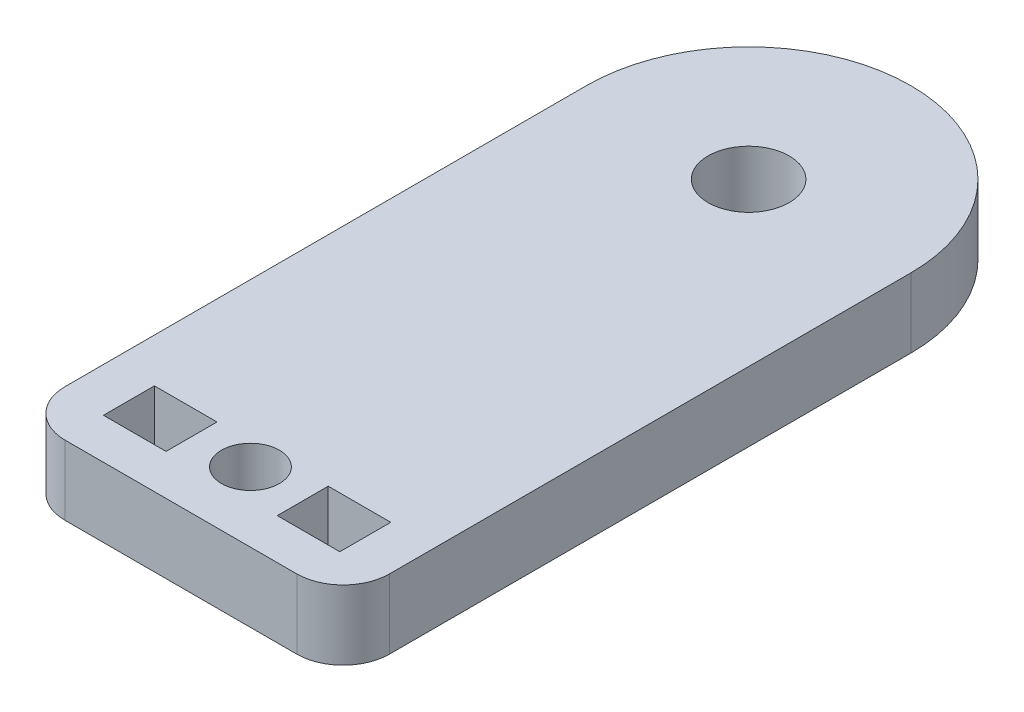
ISO-10303-21;
HEADER;
FILE_DESCRIPTION(('STEP AP214'),'2;1');
FILE_NAME('part.step','',(''),(''),'','','');
FILE_SCHEMA(('AUTOMOTIVE_DESIGN { 1 0 10303 214 1 1 1 1 }'));
ENDSEC;
DATA;
#1=APPLICATION_CONTEXT('core data for automotive mechanical design processes');
#2=APPLICATION_PROTOCOL_DEFINITION('international standard','automotive_design',2000,#1);
#3=PRODUCT_CONTEXT('',#1,'mechanical');
#4=PRODUCT('Part','Part','',(#3));
#5=PRODUCT_RELATED_PRODUCT_CATEGORY('part','',(#4));
#6=PRODUCT_DEFINITION_FORMATION('','',#4);
#7=PRODUCT_DEFINITION_CONTEXT('part definition',#1,'design');
#8=PRODUCT_DEFINITION('design','',#6,#7);
#9=PRODUCT_DEFINITION_SHAPE('','',#8);
#10=(LENGTH_UNIT() NAMED_UNIT(*) SI_UNIT(.MILLI.,.METRE.));
#11=(NAMED_UNIT(*) PLANE_ANGLE_UNIT() SI_UNIT($,.RADIAN.));
#12=(NAMED_UNIT(*) SI_UNIT($,.STERADIAN.) SOLID_ANGLE_UNIT());
#13=UNCERTAINTY_MEASURE_WITH_UNIT(LENGTH_MEASURE(1.E-05),#10,'distance_accuracy_value','');
#14=(GEOMETRIC_REPRESENTATION_CONTEXT(3) GLOBAL_UNCERTAINTY_ASSIGNED_CONTEXT((#13)) GLOBAL_UNIT_ASSIGNED_CONTEXT((#10,
#11,#12)) REPRESENTATION_CONTEXT('',''));
#15=CARTESIAN_POINT('',(0.,0.,0.));
#16=DIRECTION('',(0.,0.,1.));
#17=DIRECTION('',(1.,0.,0.));
#18=AXIS2_PLACEMENT_3D('',#15,#16,#17);
#19=CARTESIAN_POINT('',(0.,3.,10.4933909457973));
#20=DIRECTION('',(0.,0.,1.));
#21=DIRECTION('',(1.,0.,0.));
#22=AXIS2_PLACEMENT_3D('',#19,#20,#21);
#23=PLANE('',#22);
#24=DIRECTION('',(-1.,0.,0.));
#25=VECTOR('',#24,1.);
#26=CARTESIAN_POINT('',(0.,0.,10.4933909457973));
#27=LINE('',#26,#25);
#28=CARTESIAN_POINT('',(5.1,0.,10.4933909457973));
#29=VERTEX_POINT('',#28);
#30=CARTESIAN_POINT('',(2.40000000000001,0.,10.4933909457973));
#31=VERTEX_POINT('',#30);
#32=EDGE_CURVE('E205',#29,#31,#27,.T.);
#33=ORIENTED_EDGE('',*,*,#32,.T.);
#34=DIRECTION('',(0.,-1.,0.));
#35=VECTOR('',#34,1.);
#36=CARTESIAN_POINT('',(2.40000000000001,3.,10.4933909457973));
#37=LINE('',#36,#35);
#38=CARTESIAN_POINT('',(2.40000000000001,3.,10.4933909457973));
#39=VERTEX_POINT('',#38);
#40=EDGE_CURVE('E11',#39,#31,#37,.T.);
#41=ORIENTED_EDGE('',*,*,#40,.F.);
#42=DIRECTION('',(-1.,0.,0.));
#43=VECTOR('',#42,1.);
#44=CARTESIAN_POINT('',(0.,3.,10.4933909457973));
#45=LINE('',#44,#43);
#46=CARTESIAN_POINT('',(5.1,3.,10.4933909457973));
#47=VERTEX_POINT('',#46);
#48=EDGE_CURVE('E152',#47,#39,#45,.T.);
#49=ORIENTED_EDGE('',*,*,#48,.F.);
#50=DIRECTION('',(0.,-1.,0.));
#51=VECTOR('',#50,1.);
#52=CARTESIAN_POINT('',(5.1,3.,10.4933909457973));
#53=LINE('',#52,#51);
#54=EDGE_CURVE('E56',#47,#29,#53,.T.);
#55=ORIENTED_EDGE('',*,*,#54,.T.);
#56=EDGE_LOOP('',(#33,#41,#49,#55));
#57=FACE_BOUND('',#56,.T.);
#58=ADVANCED_FACE('F37',(#57),#23,.F.);
#59=CARTESIAN_POINT('',(2.4,3.,0.));
#60=DIRECTION('',(-1.,0.,0.));
#61=DIRECTION('',(0.,0.,1.));
#62=AXIS2_PLACEMENT_3D('',#59,#60,#61);
#63=PLANE('',#62);
#64=DIRECTION('',(0.,0.,-1.));
#65=VECTOR('',#64,1.);
#66=CARTESIAN_POINT('',(2.4,0.,0.));
#67=LINE('',#66,#65);
#68=CARTESIAN_POINT('',(2.4,0.,8.29339094579726));
#69=VERTEX_POINT('',#68);
#70=EDGE_CURVE('E158',#31,#69,#67,.T.);
#71=ORIENTED_EDGE('',*,*,#70,.T.);
#72=DIRECTION('',(0.,-1.,0.));
#73=VECTOR('',#72,1.);
#74=CARTESIAN_POINT('',(2.4,3.,8.29339094579726));
#75=LINE('',#74,#73);
#76=CARTESIAN_POINT('',(2.4,3.,8.29339094579726));
#77=VERTEX_POINT('',#76);
#78=EDGE_CURVE('E47',#77,#69,#75,.T.);
#79=ORIENTED_EDGE('',*,*,#78,.F.);
#80=DIRECTION('',(0.,0.,-1.));
#81=VECTOR('',#80,1.);
#82=CARTESIAN_POINT('',(2.4,3.,0.));
#83=LINE('',#82,#81);
#84=EDGE_CURVE('E146',#39,#77,#83,.T.);
#85=ORIENTED_EDGE('',*,*,#84,.F.);
#86=ORIENTED_EDGE('',*,*,#40,.T.);
#87=EDGE_LOOP('',(#71,#79,#85,#86));
#88=FACE_BOUND('',#87,.T.);
#89=ADVANCED_FACE('F157',(#88),#63,.F.);
#90=CARTESIAN_POINT('',(0.,3.,8.29339094579726));
#91=DIRECTION('',(0.,0.,1.));
#92=DIRECTION('',(1.,0.,0.));
#93=AXIS2_PLACEMENT_3D('',#90,#91,#92);
#94=PLANE('',#93);
#95=DIRECTION('',(-1.,0.,0.));
#96=VECTOR('',#95,1.);
#97=CARTESIAN_POINT('',(0.,0.,8.29339094579726));
#98=LINE('',#97,#96);
#99=CARTESIAN_POINT('',(5.1,0.,8.29339094579725));
#100=VERTEX_POINT('',#99);
#101=EDGE_CURVE('E208',#100,#69,#98,.T.);
#102=ORIENTED_EDGE('',*,*,#101,.F.);
#103=DIRECTION('',(0.,-1.,0.));
#104=VECTOR('',#103,1.);
#105=CARTESIAN_POINT('',(5.1,3.,8.29339094579725));
#106=LINE('',#105,#104);
#107=CARTESIAN_POINT('',(5.1,3.,8.29339094579725));
#108=VERTEX_POINT('',#107);
#109=EDGE_CURVE('E100',#108,#100,#106,.T.);
#110=ORIENTED_EDGE('',*,*,#109,.F.);
#111=DIRECTION('',(-1.,0.,0.));
#112=VECTOR('',#111,1.);
#113=CARTESIAN_POINT('',(0.,3.,8.29339094579726));
#114=LINE('',#113,#112);
#115=EDGE_CURVE('E151',#108,#77,#114,.T.);
#116=ORIENTED_EDGE('',*,*,#115,.T.);
#117=ORIENTED_EDGE('',*,*,#78,.T.);
#118=EDGE_LOOP('',(#102,#110,#116,#117));
#119=FACE_BOUND('',#118,.T.);
#120=ADVANCED_FACE('F162',(#119),#94,.T.);
#121=CARTESIAN_POINT('',(-2.4,3.,0.));
#122=DIRECTION('',(-1.,0.,0.));
#123=DIRECTION('',(0.,0.,1.));
#124=AXIS2_PLACEMENT_3D('',#121,#122,#123);
#125=PLANE('',#124);
#126=DIRECTION('',(0.,0.,-1.));
#127=VECTOR('',#126,1.);
#128=CARTESIAN_POINT('',(-2.4,0.,0.));
#129=LINE('',#128,#127);
#130=CARTESIAN_POINT('',(-2.4,0.,10.4933909457973));
#131=VERTEX_POINT('',#130);
#132=CARTESIAN_POINT('',(-2.4,0.,8.29339094579726));
#133=VERTEX_POINT('',#132);
#134=EDGE_CURVE('E193',#131,#133,#129,.T.);
#135=ORIENTED_EDGE('',*,*,#134,.F.);
#136=DIRECTION('',(0.,-1.,0.));
#137=VECTOR('',#136,1.);
#138=CARTESIAN_POINT('',(-2.4,3.,10.4933909457973));
#139=LINE('',#138,#137);
#140=CARTESIAN_POINT('',(-2.4,3.,10.4933909457973));
#141=VERTEX_POINT('',#140);
#142=EDGE_CURVE('E215',#141,#131,#139,.T.);
#143=ORIENTED_EDGE('',*,*,#142,.F.);
#144=DIRECTION('',(0.,0.,-1.));
#145=VECTOR('',#144,1.);
#146=CARTESIAN_POINT('',(-2.4,3.,0.));
#147=LINE('',#146,#145);
#148=CARTESIAN_POINT('',(-2.4,3.,8.29339094579726));
#149=VERTEX_POINT('',#148);
#150=EDGE_CURVE('E447',#141,#149,#147,.T.);
#151=ORIENTED_EDGE('',*,*,#150,.T.);
#152=DIRECTION('',(0.,-1.,0.));
#153=VECTOR('',#152,1.);
#154=CARTESIAN_POINT('',(-2.4,3.,8.29339094579726));
#155=LINE('',#154,#153);
#156=EDGE_CURVE('E217',#149,#133,#155,.T.);
#157=ORIENTED_EDGE('',*,*,#156,.T.);
#158=EDGE_LOOP('',(#135,#143,#151,#157));
#159=FACE_BOUND('',#158,.T.);
#160=ADVANCED_FACE('F294',(#159),#125,.T.);
#161=CARTESIAN_POINT('',(0.,3.,10.4933909457973));
#162=DIRECTION('',(0.,0.,-1.));
#163=DIRECTION('',(-1.,0.,0.));
#164=AXIS2_PLACEMENT_3D('',#161,#162,#163);
#165=PLANE('',#164);
#166=DIRECTION('',(1.,0.,0.));
#167=VECTOR('',#166,1.);
#168=CARTESIAN_POINT('',(0.,0.,10.4933909457973));
#169=LINE('',#168,#167);
#170=CARTESIAN_POINT('',(-5.1,0.,10.4933909457973));
#171=VERTEX_POINT('',#170);
#172=EDGE_CURVE('E196',#171,#131,#169,.T.);
#173=ORIENTED_EDGE('',*,*,#172,.F.);
#174=DIRECTION('',(0.,-1.,0.));
#175=VECTOR('',#174,1.);
#176=CARTESIAN_POINT('',(-5.1,3.,10.4933909457973));
#177=LINE('',#176,#175);
#178=CARTESIAN_POINT('',(-5.1,3.,10.4933909457973));
#179=VERTEX_POINT('',#178);
#180=EDGE_CURVE('E222',#179,#171,#177,.T.);
#181=ORIENTED_EDGE('',*,*,#180,.F.);
#182=DIRECTION('',(1.,0.,0.));
#183=VECTOR('',#182,1.);
#184=CARTESIAN_POINT('',(0.,3.,10.4933909457973));
#185=LINE('',#184,#183);
#186=EDGE_CURVE('E450',#179,#141,#185,.T.);
#187=ORIENTED_EDGE('',*,*,#186,.T.);
#188=ORIENTED_EDGE('',*,*,#142,.T.);
#189=EDGE_LOOP('',(#173,#181,#187,#188));
#190=FACE_BOUND('',#189,.T.);
#191=ADVANCED_FACE('F290',(#190),#165,.T.);
#192=CARTESIAN_POINT('',(-5.1,3.,0.));
#193=DIRECTION('',(-1.,0.,0.));
#194=DIRECTION('',(0.,0.,1.));
#195=AXIS2_PLACEMENT_3D('',#192,#193,#194);
#196=PLANE('',#195);
#197=DIRECTION('',(0.,0.,-1.));
#198=VECTOR('',#197,1.);
#199=CARTESIAN_POINT('',(-5.1,0.,0.));
#200=LINE('',#199,#198);
#201=CARTESIAN_POINT('',(-5.1,0.,8.29339094579726));
#202=VERTEX_POINT('',#201);
#203=EDGE_CURVE('E199',#171,#202,#200,.T.);
#204=ORIENTED_EDGE('',*,*,#203,.T.);
#205=DIRECTION('',(0.,-1.,0.));
#206=VECTOR('',#205,1.);
#207=CARTESIAN_POINT('',(-5.1,3.,8.29339094579726));
#208=LINE('',#207,#206);
#209=CARTESIAN_POINT('',(-5.1,3.,8.29339094579726));
#210=VERTEX_POINT('',#209);
#211=EDGE_CURVE('E219',#210,#202,#208,.T.);
#212=ORIENTED_EDGE('',*,*,#211,.F.);
#213=DIRECTION('',(0.,0.,-1.));
#214=VECTOR('',#213,1.);
#215=CARTESIAN_POINT('',(-5.1,3.,0.));
#216=LINE('',#215,#214);
#217=EDGE_CURVE('E457',#179,#210,#216,.T.);
#218=ORIENTED_EDGE('',*,*,#217,.F.);
#219=ORIENTED_EDGE('',*,*,#180,.T.);
#220=EDGE_LOOP('',(#204,#212,#218,#219));
#221=FACE_BOUND('',#220,.T.);
#222=ADVANCED_FACE('F287',(#221),#196,.F.);
#223=CARTESIAN_POINT('',(-4.99999999999999,3.,10.25));
#224=DIRECTION('',(0.,-1.,0.));
#225=DIRECTION('',(0.,0.,-1.));
#226=AXIS2_PLACEMENT_3D('',#223,#224,#225);
#227=CYLINDRICAL_SURFACE('',#226,2.);
#228=CARTESIAN_POINT('',(-4.99999999999999,0.,10.25));
#229=DIRECTION('',(0.,1.,0.));
#230=DIRECTION('',(0.,0.,1.));
#231=AXIS2_PLACEMENT_3D('',#228,#229,#230);
#232=CIRCLE('',#231,2.);
#233=CARTESIAN_POINT('',(-4.99999999999998,0.,12.25));
#234=VERTEX_POINT('',#233);
#235=CARTESIAN_POINT('',(-6.99999999999999,0.,10.25));
#236=VERTEX_POINT('',#235);
#237=EDGE_CURVE('E172',#234,#236,#232,.F.);
#238=ORIENTED_EDGE('',*,*,#237,.F.);
#239=DIRECTION('',(0.,-1.,0.));
#240=VECTOR('',#239,1.);
#241=CARTESIAN_POINT('',(-4.99999999999998,3.,12.25));
#242=LINE('',#241,#240);
#243=CARTESIAN_POINT('',(-4.99999999999998,3.,12.25));
#244=VERTEX_POINT('',#243);
#245=EDGE_CURVE('E41',#244,#234,#242,.T.);
#246=ORIENTED_EDGE('',*,*,#245,.F.);
#247=CARTESIAN_POINT('',(-4.99999999999999,3.,10.25));
#248=DIRECTION('',(0.,1.,0.));
#249=DIRECTION('',(0.,0.,1.));
#250=AXIS2_PLACEMENT_3D('',#247,#248,#249);
#251=CIRCLE('',#250,2.);
#252=CARTESIAN_POINT('',(-6.99999999999999,3.,10.25));
#253=VERTEX_POINT('',#252);
#254=EDGE_CURVE('E248',#244,#253,#251,.F.);
#255=ORIENTED_EDGE('',*,*,#254,.T.);
#256=DIRECTION('',(0.,-1.,0.));
#257=VECTOR('',#256,1.);
#258=CARTESIAN_POINT('',(-6.99999999999999,3.,10.25));
#259=LINE('',#258,#257);
#260=EDGE_CURVE('E165',#253,#236,#259,.T.);
#261=ORIENTED_EDGE('',*,*,#260,.T.);
#262=EDGE_LOOP('',(#238,#246,#255,#261));
#263=FACE_BOUND('',#262,.T.);
#264=ADVANCED_FACE('F247',(#263),#227,.T.);
#265=CARTESIAN_POINT('',(0.,3.,12.25));
#266=DIRECTION('',(0.,0.,-1.));
#267=DIRECTION('',(-1.,0.,0.));
#268=AXIS2_PLACEMENT_3D('',#265,#266,#267);
#269=PLANE('',#268);
#270=DIRECTION('',(1.,0.,0.));
#271=VECTOR('',#270,1.);
#272=CARTESIAN_POINT('',(0.,0.,12.25));
#273=LINE('',#272,#271);
#274=CARTESIAN_POINT('',(4.99999999999999,0.,12.25));
#275=VERTEX_POINT('',#274);
#276=EDGE_CURVE('E175',#234,#275,#273,.T.);
#277=ORIENTED_EDGE('',*,*,#276,.T.);
#278=DIRECTION('',(0.,-1.,0.));
#279=VECTOR('',#278,1.);
#280=CARTESIAN_POINT('',(4.99999999999999,3.,12.25));
#281=LINE('',#280,#279);
#282=CARTESIAN_POINT('',(4.99999999999999,3.,12.25));
#283=VERTEX_POINT('',#282);
#284=EDGE_CURVE('E233',#283,#275,#281,.T.);
#285=ORIENTED_EDGE('',*,*,#284,.F.);
#286=DIRECTION('',(1.,0.,0.));
#287=VECTOR('',#286,1.);
#288=CARTESIAN_POINT('',(0.,3.,12.25));
#289=LINE('',#288,#287);
#290=EDGE_CURVE('E241',#244,#283,#289,.T.);
#291=ORIENTED_EDGE('',*,*,#290,.F.);
#292=ORIENTED_EDGE('',*,*,#245,.T.);
#293=EDGE_LOOP('',(#277,#285,#291,#292));
#294=FACE_BOUND('',#293,.T.);
#295=ADVANCED_FACE('F239',(#294),#269,.F.);
#296=CARTESIAN_POINT('',(5.,3.,10.25));
#297=DIRECTION('',(0.,-1.,0.));
#298=DIRECTION('',(0.,0.,-1.));
#299=AXIS2_PLACEMENT_3D('',#296,#297,#298);
#300=CYLINDRICAL_SURFACE('',#299,2.);
#301=CARTESIAN_POINT('',(5.,0.,10.25));
#302=DIRECTION('',(0.,1.,0.));
#303=DIRECTION('',(0.,0.,1.));
#304=AXIS2_PLACEMENT_3D('',#301,#302,#303);
#305=CIRCLE('',#304,2.);
#306=CARTESIAN_POINT('',(7.,0.,10.25));
#307=VERTEX_POINT('',#306);
#308=EDGE_CURVE('E178',#275,#307,#305,.T.);
#309=ORIENTED_EDGE('',*,*,#308,.T.);
#310=DIRECTION('',(0.,-1.,0.));
#311=VECTOR('',#310,1.);
#312=CARTESIAN_POINT('',(7.,3.,10.25));
#313=LINE('',#312,#311);
#314=CARTESIAN_POINT('',(7.,3.,10.25));
#315=VERTEX_POINT('',#314);
#316=EDGE_CURVE('E231',#315,#307,#313,.T.);
#317=ORIENTED_EDGE('',*,*,#316,.F.);
#318=CARTESIAN_POINT('',(5.,3.,10.25));
#319=DIRECTION('',(0.,1.,0.));
#320=DIRECTION('',(0.,0.,1.));
#321=AXIS2_PLACEMENT_3D('',#318,#319,#320);
#322=CIRCLE('',#321,2.);
#323=EDGE_CURVE('E466',#283,#315,#322,.T.);
#324=ORIENTED_EDGE('',*,*,#323,.F.);
#325=ORIENTED_EDGE('',*,*,#284,.T.);
#326=EDGE_LOOP('',(#309,#317,#324,#325));
#327=FACE_BOUND('',#326,.T.);
#328=ADVANCED_FACE('F265',(#327),#300,.T.);
#329=CARTESIAN_POINT('',(7.,3.,0.));
#330=DIRECTION('',(-1.,0.,0.));
#331=DIRECTION('',(0.,0.,1.));
#332=AXIS2_PLACEMENT_3D('',#329,#330,#331);
#333=PLANE('',#332);
#334=DIRECTION('',(0.,0.,-1.));
#335=VECTOR('',#334,1.);
#336=CARTESIAN_POINT('',(7.,0.,0.));
#337=LINE('',#336,#335);
#338=CARTESIAN_POINT('',(7.,0.,-12.25));
#339=VERTEX_POINT('',#338);
#340=EDGE_CURVE('E181',#307,#339,#337,.T.);
#341=ORIENTED_EDGE('',*,*,#340,.T.);
#342=DIRECTION('',(0.,-1.,0.));
#343=VECTOR('',#342,1.);
#344=CARTESIAN_POINT('',(7.,3.,-12.25));
#345=LINE('',#344,#343);
#346=CARTESIAN_POINT('',(7.,3.,-12.25));
#347=VERTEX_POINT('',#346);
#348=EDGE_CURVE('E228',#347,#339,#345,.T.);
#349=ORIENTED_EDGE('',*,*,#348,.F.);
#350=DIRECTION('',(0.,0.,-1.));
#351=VECTOR('',#350,1.);
#352=CARTESIAN_POINT('',(7.,3.,0.));
#353=LINE('',#352,#351);
#354=EDGE_CURVE('E263',#315,#347,#353,.T.);
#355=ORIENTED_EDGE('',*,*,#354,.F.);
#356=ORIENTED_EDGE('',*,*,#316,.T.);
#357=EDGE_LOOP('',(#341,#349,#355,#356));
#358=FACE_BOUND('',#357,.T.);
#359=ADVANCED_FACE('F261',(#358),#333,.F.);
#360=CARTESIAN_POINT('',(0.,3.,-12.25));
#361=DIRECTION('',(0.,-1.,0.));
#362=DIRECTION('',(0.,0.,-1.));
#363=AXIS2_PLACEMENT_3D('',#360,#361,#362);
#364=CYLINDRICAL_SURFACE('',#363,7.);
#365=CARTESIAN_POINT('',(0.,0.,-12.25));
#366=DIRECTION('',(0.,1.,0.));
#367=DIRECTION('',(0.,0.,1.));
#368=AXIS2_PLACEMENT_3D('',#365,#366,#367);
#369=CIRCLE('',#368,7.);
#370=CARTESIAN_POINT('',(-7.,0.,-12.25));
#371=VERTEX_POINT('',#370);
#372=EDGE_CURVE('E184',#339,#371,#369,.T.);
#373=ORIENTED_EDGE('',*,*,#372,.T.);
#374=DIRECTION('',(0.,-1.,0.));
#375=VECTOR('',#374,1.);
#376=CARTESIAN_POINT('',(-7.,3.,-12.25));
#377=LINE('',#376,#375);
#378=CARTESIAN_POINT('',(-7.,3.,-12.25));
#379=VERTEX_POINT('',#378);
#380=EDGE_CURVE('E226',#379,#371,#377,.T.);
#381=ORIENTED_EDGE('',*,*,#380,.F.);
#382=CARTESIAN_POINT('',(0.,3.,-12.25));
#383=DIRECTION('',(0.,1.,0.));
#384=DIRECTION('',(0.,0.,1.));
#385=AXIS2_PLACEMENT_3D('',#382,#383,#384);
#386=CIRCLE('',#385,7.);
#387=EDGE_CURVE('E258',#347,#379,#386,.T.);
#388=ORIENTED_EDGE('',*,*,#387,.F.);
#389=ORIENTED_EDGE('',*,*,#348,.T.);
#390=EDGE_LOOP('',(#373,#381,#388,#389));
#391=FACE_BOUND('',#390,.T.);
#392=ADVANCED_FACE('F257',(#391),#364,.T.);
#393=CARTESIAN_POINT('',(0.,3.,8.29339094579726));
#394=DIRECTION('',(0.,0.,-1.));
#395=DIRECTION('',(-1.,0.,0.));
#396=AXIS2_PLACEMENT_3D('',#393,#394,#395);
#397=PLANE('',#396);
#398=DIRECTION('',(1.,0.,0.));
#399=VECTOR('',#398,1.);
#400=CARTESIAN_POINT('',(0.,0.,8.29339094579726));
#401=LINE('',#400,#399);
#402=EDGE_CURVE('E202',#202,#133,#401,.T.);
#403=ORIENTED_EDGE('',*,*,#402,.T.);
#404=ORIENTED_EDGE('',*,*,#156,.F.);
#405=DIRECTION('',(1.,0.,0.));
#406=VECTOR('',#405,1.);
#407=CARTESIAN_POINT('',(0.,3.,8.29339094579726));
#408=LINE('',#407,#406);
#409=EDGE_CURVE('E451',#210,#149,#408,.T.);
#410=ORIENTED_EDGE('',*,*,#409,.F.);
#411=ORIENTED_EDGE('',*,*,#211,.T.);
#412=EDGE_LOOP('',(#403,#404,#410,#411));
#413=FACE_BOUND('',#412,.T.);
#414=ADVANCED_FACE('F282',(#413),#397,.F.);
#415=CARTESIAN_POINT('',(0.,3.,9.25));
#416=DIRECTION('',(0.,-1.,0.));
#417=DIRECTION('',(0.,0.,-1.));
#418=AXIS2_PLACEMENT_3D('',#415,#416,#417);
#419=CYLINDRICAL_SURFACE('',#418,1.25);
#420=CARTESIAN_POINT('',(0.,3.,9.25));
#421=DIRECTION('',(0.,1.,0.));
#422=DIRECTION('',(0.,0.,1.));
#423=AXIS2_PLACEMENT_3D('',#420,#421,#422);
#424=CIRCLE('',#423,1.25);
#425=CARTESIAN_POINT('',(0.,3.,10.5));
#426=VERTEX_POINT('',#425);
#427=EDGE_CURVE('E443',#426,#426,#424,.T.);
#428=ORIENTED_EDGE('',*,*,#427,.T.);
#429=EDGE_LOOP('',(#428));
#430=FACE_BOUND('',#429,.T.);
#431=CARTESIAN_POINT('',(0.,0.,9.25));
#432=DIRECTION('',(0.,1.,0.));
#433=DIRECTION('',(0.,0.,1.));
#434=AXIS2_PLACEMENT_3D('',#431,#432,#433);
#435=CIRCLE('',#434,1.25);
#436=CARTESIAN_POINT('',(0.,0.,10.5));
#437=VERTEX_POINT('',#436);
#438=EDGE_CURVE('E190',#437,#437,#435,.T.);
#439=ORIENTED_EDGE('',*,*,#438,.F.);
#440=EDGE_LOOP('',(#439));
#441=FACE_BOUND('',#440,.T.);
#442=ADVANCED_FACE('F285',(#430,#441),#419,.F.);
#443=CARTESIAN_POINT('',(-7.,3.,0.));
#444=DIRECTION('',(-1.,0.,0.));
#445=DIRECTION('',(0.,0.,1.));
#446=AXIS2_PLACEMENT_3D('',#443,#444,#445);
#447=PLANE('',#446);
#448=DIRECTION('',(0.,0.,-1.));
#449=VECTOR('',#448,1.);
#450=CARTESIAN_POINT('',(-7.,0.,0.));
#451=LINE('',#450,#449);
#452=EDGE_CURVE('E187',#236,#371,#451,.T.);
#453=ORIENTED_EDGE('',*,*,#452,.F.);
#454=ORIENTED_EDGE('',*,*,#260,.F.);
#455=DIRECTION('',(0.,0.,-1.));
#456=VECTOR('',#455,1.);
#457=CARTESIAN_POINT('',(-7.,3.,0.));
#458=LINE('',#457,#456);
#459=EDGE_CURVE('E253',#253,#379,#458,.T.);
#460=ORIENTED_EDGE('',*,*,#459,.T.);
#461=ORIENTED_EDGE('',*,*,#380,.T.);
#462=EDGE_LOOP('',(#453,#454,#460,#461));
#463=FACE_BOUND('',#462,.T.);
#464=ADVANCED_FACE('F252',(#463),#447,.T.);
#465=CARTESIAN_POINT('',(0.,3.,-12.25));
#466=DIRECTION('',(0.,-1.,0.));
#467=DIRECTION('',(0.,0.,-1.));
#468=AXIS2_PLACEMENT_3D('',#465,#466,#467);
#469=CYLINDRICAL_SURFACE('',#468,1.75);
#470=CARTESIAN_POINT('',(0.,3.,-12.25));
#471=DIRECTION('',(0.,1.,0.));
#472=DIRECTION('',(0.,0.,1.));
#473=AXIS2_PLACEMENT_3D('',#470,#471,#472);
#474=CIRCLE('',#473,1.75);
#475=CARTESIAN_POINT('',(0.,3.,-10.5));
#476=VERTEX_POINT('',#475);
#477=EDGE_CURVE('E213',#476,#476,#474,.T.);
#478=ORIENTED_EDGE('',*,*,#477,.T.);
#479=EDGE_LOOP('',(#478));
#480=FACE_BOUND('',#479,.T.);
#481=CARTESIAN_POINT('',(0.,0.,-12.25));
#482=DIRECTION('',(0.,1.,0.));
#483=DIRECTION('',(0.,0.,1.));
#484=AXIS2_PLACEMENT_3D('',#481,#482,#483);
#485=CIRCLE('',#484,1.75);
#486=CARTESIAN_POINT('',(0.,0.,-10.5));
#487=VERTEX_POINT('',#486);
#488=EDGE_CURVE('E169',#487,#487,#485,.T.);
#489=ORIENTED_EDGE('',*,*,#488,.F.);
#490=EDGE_LOOP('',(#489));
#491=FACE_BOUND('',#490,.T.);
#492=ADVANCED_FACE('F39',(#480,#491),#469,.F.);
#493=CARTESIAN_POINT('',(5.1,3.,0.));
#494=DIRECTION('',(-1.,0.,0.));
#495=DIRECTION('',(0.,0.,1.));
#496=AXIS2_PLACEMENT_3D('',#493,#494,#495);
#497=PLANE('',#496);
#498=DIRECTION('',(0.,0.,-1.));
#499=VECTOR('',#498,1.);
#500=CARTESIAN_POINT('',(5.1,0.,0.));
#501=LINE('',#500,#499);
#502=EDGE_CURVE('E210',#29,#100,#501,.T.);
#503=ORIENTED_EDGE('',*,*,#502,.F.);
#504=ORIENTED_EDGE('',*,*,#54,.F.);
#505=DIRECTION('',(0.,0.,-1.));
#506=VECTOR('',#505,1.);
#507=CARTESIAN_POINT('',(5.1,3.,0.));
#508=LINE('',#507,#506);
#509=EDGE_CURVE('E163',#47,#108,#508,.T.);
#510=ORIENTED_EDGE('',*,*,#509,.T.);
#511=ORIENTED_EDGE('',*,*,#109,.T.);
#512=EDGE_LOOP('',(#503,#504,#510,#511));
#513=FACE_BOUND('',#512,.T.);
#514=ADVANCED_FACE('F327',(#513),#497,.T.);
#515=CARTESIAN_POINT('',(0.,3.,0.));
#516=DIRECTION('',(0.,1.,0.));
#517=DIRECTION('',(0.,0.,1.));
#518=AXIS2_PLACEMENT_3D('',#515,#516,#517);
#519=PLANE('',#518);
#520=ORIENTED_EDGE('',*,*,#477,.F.);
#521=EDGE_LOOP('',(#520));
#522=FACE_BOUND('',#521,.T.);
#523=ORIENTED_EDGE('',*,*,#254,.F.);
#524=ORIENTED_EDGE('',*,*,#290,.T.);
#525=ORIENTED_EDGE('',*,*,#323,.T.);
#526=ORIENTED_EDGE('',*,*,#354,.T.);
#527=ORIENTED_EDGE('',*,*,#387,.T.);
#528=ORIENTED_EDGE('',*,*,#459,.F.);
#529=EDGE_LOOP('',(#523,#524,#525,#526,#527,#528));
#530=FACE_BOUND('',#529,.T.);
#531=ORIENTED_EDGE('',*,*,#427,.F.);
#532=EDGE_LOOP('',(#531));
#533=FACE_BOUND('',#532,.T.);
#534=ORIENTED_EDGE('',*,*,#150,.F.);
#535=ORIENTED_EDGE('',*,*,#186,.F.);
#536=ORIENTED_EDGE('',*,*,#217,.T.);
#537=ORIENTED_EDGE('',*,*,#409,.T.);
#538=EDGE_LOOP('',(#534,#535,#536,#537));
#539=FACE_BOUND('',#538,.T.);
#540=ORIENTED_EDGE('',*,*,#48,.T.);
#541=ORIENTED_EDGE('',*,*,#84,.T.);
#542=ORIENTED_EDGE('',*,*,#115,.F.);
#543=ORIENTED_EDGE('',*,*,#509,.F.);
#544=EDGE_LOOP('',(#540,#541,#542,#543));
#545=FACE_BOUND('',#544,.T.);
#546=ADVANCED_FACE('F148',(#522,#530,#533,#539,#545),#519,.T.);
#547=CARTESIAN_POINT('',(0.,0.,0.));
#548=DIRECTION('',(0.,1.,0.));
#549=DIRECTION('',(0.,0.,1.));
#550=AXIS2_PLACEMENT_3D('',#547,#548,#549);
#551=PLANE('',#550);
#552=ORIENTED_EDGE('',*,*,#488,.T.);
#553=EDGE_LOOP('',(#552));
#554=FACE_BOUND('',#553,.T.);
#555=ORIENTED_EDGE('',*,*,#237,.T.);
#556=ORIENTED_EDGE('',*,*,#452,.T.);
#557=ORIENTED_EDGE('',*,*,#372,.F.);
#558=ORIENTED_EDGE('',*,*,#340,.F.);
#559=ORIENTED_EDGE('',*,*,#308,.F.);
#560=ORIENTED_EDGE('',*,*,#276,.F.);
#561=EDGE_LOOP('',(#555,#556,#557,#558,#559,#560));
#562=FACE_BOUND('',#561,.T.);
#563=ORIENTED_EDGE('',*,*,#438,.T.);
#564=EDGE_LOOP('',(#563));
#565=FACE_BOUND('',#564,.T.);
#566=ORIENTED_EDGE('',*,*,#134,.T.);
#567=ORIENTED_EDGE('',*,*,#402,.F.);
#568=ORIENTED_EDGE('',*,*,#203,.F.);
#569=ORIENTED_EDGE('',*,*,#172,.T.);
#570=EDGE_LOOP('',(#566,#567,#568,#569));
#571=FACE_BOUND('',#570,.T.);
#572=ORIENTED_EDGE('',*,*,#32,.F.);
#573=ORIENTED_EDGE('',*,*,#502,.T.);
#574=ORIENTED_EDGE('',*,*,#101,.T.);
#575=ORIENTED_EDGE('',*,*,#70,.F.);
#576=EDGE_LOOP('',(#572,#573,#574,#575));
#577=FACE_BOUND('',#576,.T.);
#578=ADVANCED_FACE('F244',(#554,#562,#565,#571,#577),#551,.F.);
#579=CLOSED_SHELL('',(#58,#89,#120,#160,#191,#222,#264,#295,#328,#359,#392,#414,#442,#464,#492,
#514,#546,#578));
#580=MANIFOLD_SOLID_BREP('B2',#579);
#581=ADVANCED_BREP_SHAPE_REPRESENTATION('',(#18,#580),#14);
#582=SHAPE_DEFINITION_REPRESENTATION(#9,#581);
ENDSEC;
END-ISO-10303-21;
